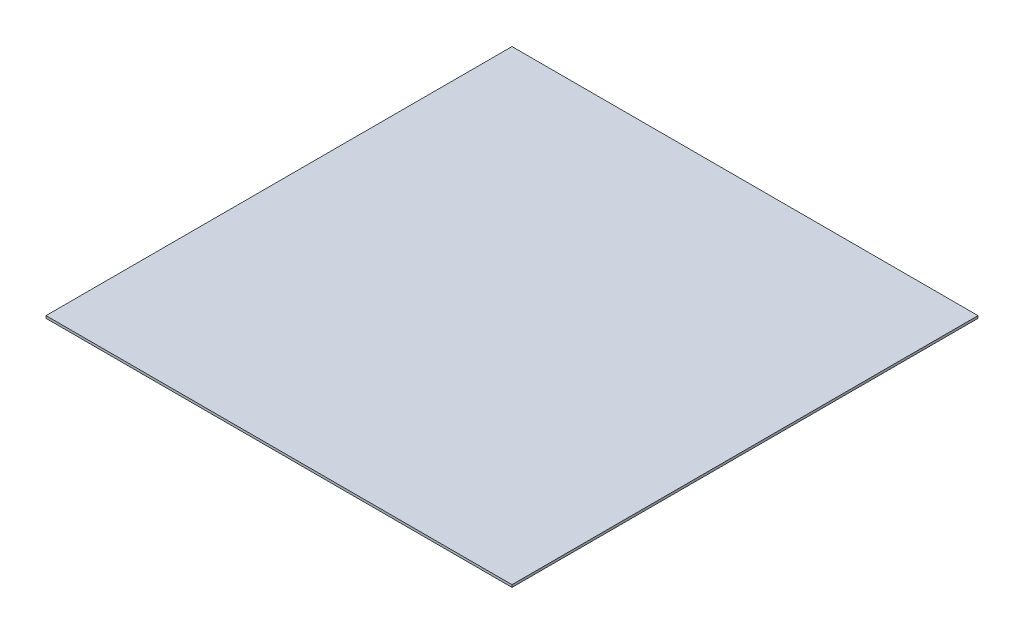
ISO-10303-21;
HEADER;
FILE_DESCRIPTION(('STEP AP214'),'2;1');
FILE_NAME('part.step','',(''),(''),'','','');
FILE_SCHEMA(('AUTOMOTIVE_DESIGN { 1 0 10303 214 1 1 1 1 }'));
ENDSEC;
DATA;
#1=APPLICATION_CONTEXT('core data for automotive mechanical design processes');
#2=APPLICATION_PROTOCOL_DEFINITION('international standard','automotive_design',2000,#1);
#3=PRODUCT_CONTEXT('',#1,'mechanical');
#4=PRODUCT('Part','Part','',(#3));
#5=PRODUCT_RELATED_PRODUCT_CATEGORY('part','',(#4));
#6=PRODUCT_DEFINITION_FORMATION('','',#4);
#7=PRODUCT_DEFINITION_CONTEXT('part definition',#1,'design');
#8=PRODUCT_DEFINITION('design','',#6,#7);
#9=PRODUCT_DEFINITION_SHAPE('','',#8);
#10=(LENGTH_UNIT() NAMED_UNIT(*) SI_UNIT(.MILLI.,.METRE.));
#11=(NAMED_UNIT(*) PLANE_ANGLE_UNIT() SI_UNIT($,.RADIAN.));
#12=(NAMED_UNIT(*) SI_UNIT($,.STERADIAN.) SOLID_ANGLE_UNIT());
#13=UNCERTAINTY_MEASURE_WITH_UNIT(LENGTH_MEASURE(1.E-05),#10,'distance_accuracy_value','');
#14=(GEOMETRIC_REPRESENTATION_CONTEXT(3) GLOBAL_UNCERTAINTY_ASSIGNED_CONTEXT((#13)) GLOBAL_UNIT_ASSIGNED_CONTEXT((#10,
#11,#12)) REPRESENTATION_CONTEXT('',''));
#15=CARTESIAN_POINT('',(0.,0.,0.));
#16=DIRECTION('',(0.,0.,1.));
#17=DIRECTION('',(1.,0.,0.));
#18=AXIS2_PLACEMENT_3D('',#15,#16,#17);
#19=CARTESIAN_POINT('',(-76.2,0.79375,76.2));
#20=DIRECTION('',(0.,0.,-1.));
#21=DIRECTION('',(-1.,0.,0.));
#22=AXIS2_PLACEMENT_3D('',#19,#20,#21);
#23=PLANE('',#22);
#24=DIRECTION('',(1.,0.,0.));
#25=VECTOR('',#24,1.);
#26=CARTESIAN_POINT('',(-76.2,0.,76.2));
#27=LINE('',#26,#25);
#28=CARTESIAN_POINT('',(-76.2,0.,76.2));
#29=VERTEX_POINT('',#28);
#30=CARTESIAN_POINT('',(76.2,0.,76.2));
#31=VERTEX_POINT('',#30);
#32=EDGE_CURVE('E96',#29,#31,#27,.T.);
#33=ORIENTED_EDGE('',*,*,#32,.T.);
#34=DIRECTION('',(0.,-1.,0.));
#35=VECTOR('',#34,1.);
#36=CARTESIAN_POINT('',(76.2,0.79375,76.2));
#37=LINE('',#36,#35);
#38=CARTESIAN_POINT('',(76.2,0.79375,76.2));
#39=VERTEX_POINT('',#38);
#40=EDGE_CURVE('E11',#39,#31,#37,.T.);
#41=ORIENTED_EDGE('',*,*,#40,.F.);
#42=DIRECTION('',(1.,0.,0.));
#43=VECTOR('',#42,1.);
#44=CARTESIAN_POINT('',(-76.2,0.79375,76.2));
#45=LINE('',#44,#43);
#46=CARTESIAN_POINT('',(-76.2,0.79375,76.2));
#47=VERTEX_POINT('',#46);
#48=EDGE_CURVE('E82',#47,#39,#45,.T.);
#49=ORIENTED_EDGE('',*,*,#48,.F.);
#50=DIRECTION('',(0.,-1.,0.));
#51=VECTOR('',#50,1.);
#52=CARTESIAN_POINT('',(-76.2,0.79375,76.2));
#53=LINE('',#52,#51);
#54=EDGE_CURVE('E49',#47,#29,#53,.T.);
#55=ORIENTED_EDGE('',*,*,#54,.T.);
#56=EDGE_LOOP('',(#33,#41,#49,#55));
#57=FACE_BOUND('',#56,.T.);
#58=ADVANCED_FACE('F33',(#57),#23,.F.);
#59=CARTESIAN_POINT('',(76.2,0.79375,76.2));
#60=DIRECTION('',(-1.,0.,0.));
#61=DIRECTION('',(0.,0.,1.));
#62=AXIS2_PLACEMENT_3D('',#59,#60,#61);
#63=PLANE('',#62);
#64=DIRECTION('',(0.,0.,-1.));
#65=VECTOR('',#64,1.);
#66=CARTESIAN_POINT('',(76.2,0.,76.2));
#67=LINE('',#66,#65);
#68=CARTESIAN_POINT('',(76.2,0.,-76.2));
#69=VERTEX_POINT('',#68);
#70=EDGE_CURVE('E87',#31,#69,#67,.T.);
#71=ORIENTED_EDGE('',*,*,#70,.T.);
#72=DIRECTION('',(0.,-1.,0.));
#73=VECTOR('',#72,1.);
#74=CARTESIAN_POINT('',(76.2,0.79375,-76.2));
#75=LINE('',#74,#73);
#76=CARTESIAN_POINT('',(76.2,0.79375,-76.2));
#77=VERTEX_POINT('',#76);
#78=EDGE_CURVE('E41',#77,#69,#75,.T.);
#79=ORIENTED_EDGE('',*,*,#78,.F.);
#80=DIRECTION('',(0.,0.,-1.));
#81=VECTOR('',#80,1.);
#82=CARTESIAN_POINT('',(76.2,0.79375,76.2));
#83=LINE('',#82,#81);
#84=EDGE_CURVE('E74',#39,#77,#83,.T.);
#85=ORIENTED_EDGE('',*,*,#84,.F.);
#86=ORIENTED_EDGE('',*,*,#40,.T.);
#87=EDGE_LOOP('',(#71,#79,#85,#86));
#88=FACE_BOUND('',#87,.T.);
#89=ADVANCED_FACE('F86',(#88),#63,.F.);
#90=CARTESIAN_POINT('',(-76.2,0.79375,-76.2));
#91=DIRECTION('',(0.,0.,-1.));
#92=DIRECTION('',(-1.,0.,0.));
#93=AXIS2_PLACEMENT_3D('',#90,#91,#92);
#94=PLANE('',#93);
#95=DIRECTION('',(1.,0.,0.));
#96=VECTOR('',#95,1.);
#97=CARTESIAN_POINT('',(-76.2,0.,-76.2));
#98=LINE('',#97,#96);
#99=CARTESIAN_POINT('',(-76.2,0.,-76.2));
#100=VERTEX_POINT('',#99);
#101=EDGE_CURVE('E99',#100,#69,#98,.T.);
#102=ORIENTED_EDGE('',*,*,#101,.F.);
#103=DIRECTION('',(0.,-1.,0.));
#104=VECTOR('',#103,1.);
#105=CARTESIAN_POINT('',(-76.2,0.79375,-76.2));
#106=LINE('',#105,#104);
#107=CARTESIAN_POINT('',(-76.2,0.79375,-76.2));
#108=VERTEX_POINT('',#107);
#109=EDGE_CURVE('E63',#108,#100,#106,.T.);
#110=ORIENTED_EDGE('',*,*,#109,.F.);
#111=DIRECTION('',(1.,0.,0.));
#112=VECTOR('',#111,1.);
#113=CARTESIAN_POINT('',(-76.2,0.79375,-76.2));
#114=LINE('',#113,#112);
#115=EDGE_CURVE('E81',#108,#77,#114,.T.);
#116=ORIENTED_EDGE('',*,*,#115,.T.);
#117=ORIENTED_EDGE('',*,*,#78,.T.);
#118=EDGE_LOOP('',(#102,#110,#116,#117));
#119=FACE_BOUND('',#118,.T.);
#120=ADVANCED_FACE('F90',(#119),#94,.T.);
#121=CARTESIAN_POINT('',(-76.2,0.79375,76.2));
#122=DIRECTION('',(-1.,0.,0.));
#123=DIRECTION('',(0.,0.,1.));
#124=AXIS2_PLACEMENT_3D('',#121,#122,#123);
#125=PLANE('',#124);
#126=DIRECTION('',(0.,0.,-1.));
#127=VECTOR('',#126,1.);
#128=CARTESIAN_POINT('',(-76.2,0.,76.2));
#129=LINE('',#128,#127);
#130=EDGE_CURVE('E101',#29,#100,#129,.T.);
#131=ORIENTED_EDGE('',*,*,#130,.F.);
#132=ORIENTED_EDGE('',*,*,#54,.F.);
#133=DIRECTION('',(0.,0.,-1.));
#134=VECTOR('',#133,1.);
#135=CARTESIAN_POINT('',(-76.2,0.79375,76.2));
#136=LINE('',#135,#134);
#137=EDGE_CURVE('E91',#47,#108,#136,.T.);
#138=ORIENTED_EDGE('',*,*,#137,.T.);
#139=ORIENTED_EDGE('',*,*,#109,.T.);
#140=EDGE_LOOP('',(#131,#132,#138,#139));
#141=FACE_BOUND('',#140,.T.);
#142=ADVANCED_FACE('F107',(#141),#125,.T.);
#143=CARTESIAN_POINT('',(0.,0.79375,0.));
#144=DIRECTION('',(0.,1.,0.));
#145=DIRECTION('',(0.,0.,1.));
#146=AXIS2_PLACEMENT_3D('',#143,#144,#145);
#147=PLANE('',#146);
#148=ORIENTED_EDGE('',*,*,#48,.T.);
#149=ORIENTED_EDGE('',*,*,#84,.T.);
#150=ORIENTED_EDGE('',*,*,#115,.F.);
#151=ORIENTED_EDGE('',*,*,#137,.F.);
#152=EDGE_LOOP('',(#148,#149,#150,#151));
#153=FACE_BOUND('',#152,.T.);
#154=ADVANCED_FACE('F78',(#153),#147,.T.);
#155=CARTESIAN_POINT('',(0.,0.,0.));
#156=DIRECTION('',(0.,1.,0.));
#157=DIRECTION('',(0.,0.,1.));
#158=AXIS2_PLACEMENT_3D('',#155,#156,#157);
#159=PLANE('',#158);
#160=ORIENTED_EDGE('',*,*,#32,.F.);
#161=ORIENTED_EDGE('',*,*,#130,.T.);
#162=ORIENTED_EDGE('',*,*,#101,.T.);
#163=ORIENTED_EDGE('',*,*,#70,.F.);
#164=EDGE_LOOP('',(#160,#161,#162,#163));
#165=FACE_BOUND('',#164,.T.);
#166=ADVANCED_FACE('F106',(#165),#159,.F.);
#167=CLOSED_SHELL('',(#58,#89,#120,#142,#154,#166));
#168=MANIFOLD_SOLID_BREP('B2',#167);
#169=ADVANCED_BREP_SHAPE_REPRESENTATION('',(#18,#168),#14);
#170=SHAPE_DEFINITION_REPRESENTATION(#9,#169);
ENDSEC;
END-ISO-10303-21;
